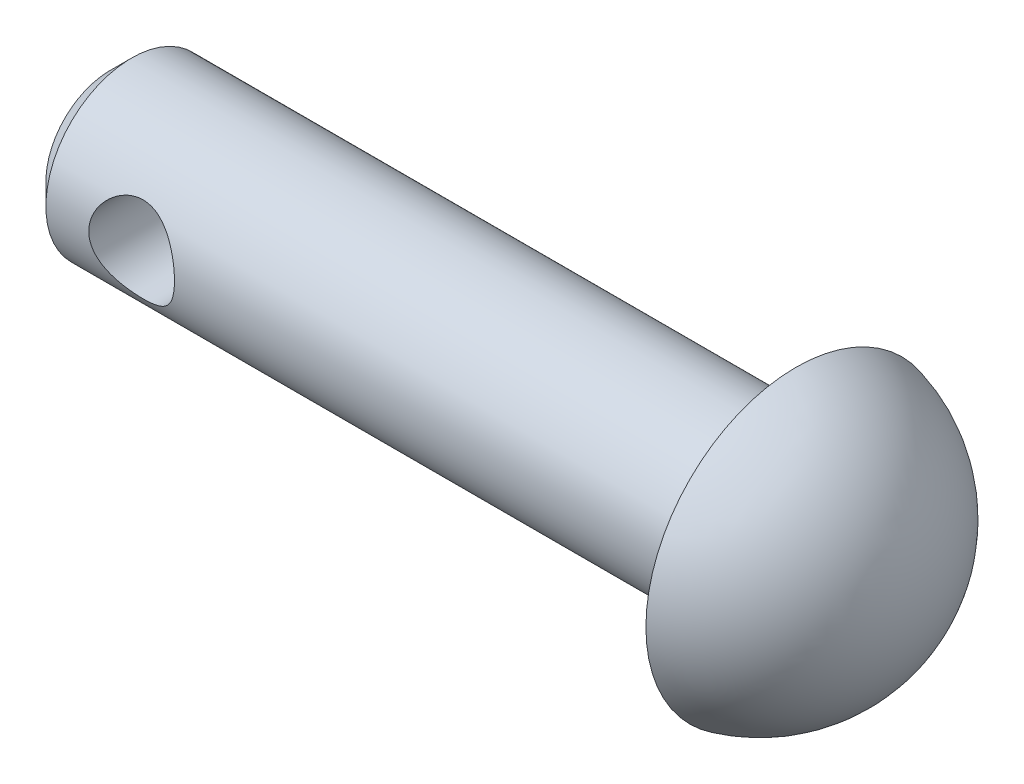
ISO-10303-21;
HEADER;
FILE_DESCRIPTION(('STEP AP214'),'2;1');
FILE_NAME('part.step','',(''),(''),'','','');
FILE_SCHEMA(('AUTOMOTIVE_DESIGN { 1 0 10303 214 1 1 1 1 }'));
ENDSEC;
DATA;
#1=APPLICATION_CONTEXT('core data for automotive mechanical design processes');
#2=APPLICATION_PROTOCOL_DEFINITION('international standard','automotive_design',2000,#1);
#3=PRODUCT_CONTEXT('',#1,'mechanical');
#4=PRODUCT('Part','Part','',(#3));
#5=PRODUCT_RELATED_PRODUCT_CATEGORY('part','',(#4));
#6=PRODUCT_DEFINITION_FORMATION('','',#4);
#7=PRODUCT_DEFINITION_CONTEXT('part definition',#1,'design');
#8=PRODUCT_DEFINITION('design','',#6,#7);
#9=PRODUCT_DEFINITION_SHAPE('','',#8);
#10=(LENGTH_UNIT() NAMED_UNIT(*) SI_UNIT(.MILLI.,.METRE.));
#11=(NAMED_UNIT(*) PLANE_ANGLE_UNIT() SI_UNIT($,.RADIAN.));
#12=(NAMED_UNIT(*) SI_UNIT($,.STERADIAN.) SOLID_ANGLE_UNIT());
#13=UNCERTAINTY_MEASURE_WITH_UNIT(LENGTH_MEASURE(1.E-05),#10,'distance_accuracy_value','');
#14=(GEOMETRIC_REPRESENTATION_CONTEXT(3) GLOBAL_UNCERTAINTY_ASSIGNED_CONTEXT((#13)) GLOBAL_UNIT_ASSIGNED_CONTEXT((#10,
#11,#12)) REPRESENTATION_CONTEXT('',''));
#15=CARTESIAN_POINT('',(0.,0.,0.));
#16=DIRECTION('',(0.,0.,1.));
#17=DIRECTION('',(1.,0.,0.));
#18=AXIS2_PLACEMENT_3D('',#15,#16,#17);
#19=CARTESIAN_POINT('',(-16.,0.,0.));
#20=DIRECTION('',(1.,0.,0.));
#21=DIRECTION('',(0.,0.,-1.));
#22=AXIS2_PLACEMENT_3D('',#19,#20,#21);
#23=CYLINDRICAL_SURFACE('',#22,2.);
#24=CARTESIAN_POINT('',(-15.5,0.,0.));
#25=DIRECTION('',(1.,0.,0.));
#26=DIRECTION('',(0.,0.,-1.));
#27=AXIS2_PLACEMENT_3D('',#24,#25,#26);
#28=CIRCLE('',#27,2.);
#29=CARTESIAN_POINT('',(-15.5,0.,-2.));
#30=VERTEX_POINT('',#29);
#31=EDGE_CURVE('E39',#30,#30,#28,.T.);
#32=ORIENTED_EDGE('',*,*,#31,.T.);
#33=EDGE_LOOP('',(#32));
#34=FACE_BOUND('',#33,.T.);
#35=CARTESIAN_POINT('',(-12.5,0.,-2.));
#36=CARTESIAN_POINT('',(-12.5000033023195,-0.0525719629529866,-1.99999713404151));
#37=CARTESIAN_POINT('',(-12.5041700731217,-0.105206599698033,-1.99790491019518));
#38=CARTESIAN_POINT('',(-12.5206528803409,-0.208920235268425,-1.98974156037396));
#39=CARTESIAN_POINT('',(-12.5329843929976,-0.259996086713504,-1.98366287828984));
#40=CARTESIAN_POINT('',(-12.5651938086168,-0.358933544880575,-1.96816279403312));
#41=CARTESIAN_POINT('',(-12.585042384248,-0.40680680293918,-1.9587543917752));
#42=CARTESIAN_POINT('',(-12.6315706213649,-0.498472616806565,-1.93745776515779));
#43=CARTESIAN_POINT('',(-12.6582497442489,-0.54226549399005,-1.9255697363353));
#44=CARTESIAN_POINT('',(-12.7195172494853,-0.627507817761919,-1.89956258258057));
#45=CARTESIAN_POINT('',(-12.7544864792396,-0.668655211122112,-1.88535199127536));
#46=CARTESIAN_POINT('',(-12.830521479247,-0.744779444866978,-1.85659970246744));
#47=CARTESIAN_POINT('',(-12.8715918517724,-0.779751583106767,-1.84205776209035));
#48=CARTESIAN_POINT('',(-12.9624833495234,-0.845252000450279,-1.81298951197347));
#49=CARTESIAN_POINT('',(-13.0127360983459,-0.875225335551638,-1.79855186970132));
#50=CARTESIAN_POINT('',(-13.1183673359862,-0.926168226890696,-1.77285978772321));
#51=CARTESIAN_POINT('',(-13.1737421287227,-0.947144214966335,-1.7616030760699));
#52=CARTESIAN_POINT('',(-13.2846651054219,-0.97813244218859,-1.74457867037808));
#53=CARTESIAN_POINT('',(-13.3400044520674,-0.988725857080443,-1.73852271583713));
#54=CARTESIAN_POINT('',(-13.4519788377795,-1.00042699330885,-1.73181889948528));
#55=CARTESIAN_POINT('',(-13.5086125408712,-1.00154408837308,-1.73116569343288));
#56=CARTESIAN_POINT('',(-13.6142860243154,-0.994687287172296,-1.73510930257248));
#57=CARTESIAN_POINT('',(-13.6634240312231,-0.987784559536823,-1.73908763662014));
#58=CARTESIAN_POINT('',(-13.759721909373,-0.966939849056934,-1.7507622873385));
#59=CARTESIAN_POINT('',(-13.8068811453053,-0.952995623897653,-1.75845978831776));
#60=CARTESIAN_POINT('',(-13.8992291325657,-0.918209780386005,-1.77687476412741));
#61=CARTESIAN_POINT('',(-13.9443463987858,-0.897215067115996,-1.78765840663998));
#62=CARTESIAN_POINT('',(-14.03063429259,-0.849041687668004,-1.81103404281404));
#63=CARTESIAN_POINT('',(-14.0718031356001,-0.821860243812469,-1.82362684780191));
#64=CARTESIAN_POINT('',(-14.1545212527432,-0.75806605491279,-1.85113157903286));
#65=CARTESIAN_POINT('',(-14.1954568735762,-0.720694458369283,-1.86613510236746));
#66=CARTESIAN_POINT('',(-14.2707354185909,-0.639555578741375,-1.89547623300407));
#67=CARTESIAN_POINT('',(-14.3050751920339,-0.595785256574287,-1.90981351958801));
#68=CARTESIAN_POINT('',(-14.3676856610297,-0.50051650583185,-1.93701987282964));
#69=CARTESIAN_POINT('',(-14.3956004724457,-0.44875359159941,-1.94978984162007));
#70=CARTESIAN_POINT('',(-14.442097029043,-0.340466215488798,-1.97157881121242));
#71=CARTESIAN_POINT('',(-14.4606861850152,-0.283945576265278,-1.98060078943553));
#72=CARTESIAN_POINT('',(-14.4864754037167,-0.172766491660703,-1.99324333741436));
#73=CARTESIAN_POINT('',(-14.4944912357468,-0.118341530548326,-1.99724938301312));
#74=CARTESIAN_POINT('',(-14.5014647311345,-0.00877959994935492,-2.00073013459102));
#75=CARTESIAN_POINT('',(-14.5004266856395,0.0463570198699002,-2.00020698721312));
#76=CARTESIAN_POINT('',(-14.4897933115812,0.151232971985993,-1.99491192253441));
#77=CARTESIAN_POINT('',(-14.48086746727,0.201059408049953,-1.9904724568819));
#78=CARTESIAN_POINT('',(-14.4557619281049,0.298406892301916,-1.97822171314819));
#79=CARTESIAN_POINT('',(-14.4395814335466,0.345927685690996,-1.97041006334333));
#80=CARTESIAN_POINT('',(-14.4000015335668,0.438888608449665,-1.9518425141367));
#81=CARTESIAN_POINT('',(-14.3764089498832,0.484230397006154,-1.94100881769939));
#82=CARTESIAN_POINT('',(-14.322892464354,0.570461361698921,-1.91743974317109));
#83=CARTESIAN_POINT('',(-14.2929658654066,0.611348629775282,-1.90470355565785));
#84=CARTESIAN_POINT('',(-14.2242395746671,0.691767689290653,-1.87708221337464));
#85=CARTESIAN_POINT('',(-14.1848571315464,0.730772077824639,-1.86210884848441));
#86=CARTESIAN_POINT('',(-14.1000748487307,0.80185632111324,-1.83262391603874));
#87=CARTESIAN_POINT('',(-14.0546708811836,0.833931385690841,-1.81811267381526));
#88=CARTESIAN_POINT('',(-13.9563563457997,0.891707914497696,-1.79051192226068));
#89=CARTESIAN_POINT('',(-13.9031887337914,0.917025495878639,-1.77752529663472));
#90=CARTESIAN_POINT('',(-13.7924899323075,0.958082826013804,-1.75574072368126));
#91=CARTESIAN_POINT('',(-13.7349644734988,0.973834915887571,-1.74693738240618));
#92=CARTESIAN_POINT('',(-13.6230897771386,0.99386168744968,-1.73561501008667));
#93=CARTESIAN_POINT('',(-13.568965746571,0.999092996400866,-1.73257383460491));
#94=CARTESIAN_POINT('',(-13.4605529328293,1.00068915438079,-1.73165354646175));
#95=CARTESIAN_POINT('',(-13.4062642312606,0.9970578466244,-1.73377219627553));
#96=CARTESIAN_POINT('',(-13.304516498468,0.981926125592265,-1.74237862050025));
#97=CARTESIAN_POINT('',(-13.2568995298556,0.971208314342801,-1.74843094482394));
#98=CARTESIAN_POINT('',(-13.1641918805753,0.943175358224647,-1.76371016187917));
#99=CARTESIAN_POINT('',(-13.119102017908,0.925858091159812,-1.77293807569675));
#100=CARTESIAN_POINT('',(-13.0293751490134,0.883815745300685,-1.79428530364528));
#101=CARTESIAN_POINT('',(-12.9849720981703,0.85867113781646,-1.80655722396191));
#102=CARTESIAN_POINT('',(-12.9007254638194,0.802150971636637,-1.8323533163459));
#103=CARTESIAN_POINT('',(-12.8608842694815,0.77077217123865,-1.84587813794522));
#104=CARTESIAN_POINT('',(-12.7818580176424,0.698203326664643,-1.87462323159313));
#105=CARTESIAN_POINT('',(-12.7433408976381,0.656284423010173,-1.88984983311469));
#106=CARTESIAN_POINT('',(-12.6737370165764,0.56615480622028,-1.91877752255088));
#107=CARTESIAN_POINT('',(-12.6426542605737,0.517940723256786,-1.9324777860804));
#108=CARTESIAN_POINT('',(-12.5887636372378,0.415931596819948,-1.95698009585103));
#109=CARTESIAN_POINT('',(-12.5660158305886,0.362099503934616,-1.96776096562909));
#110=CARTESIAN_POINT('',(-12.530191832081,0.250742101294193,-1.98501341363465));
#111=CARTESIAN_POINT('',(-12.5170881531704,0.193227799623168,-1.99149723372932));
#112=CARTESIAN_POINT('',(-12.5061025889241,0.112601946483385,-1.99695461909663));
#113=CARTESIAN_POINT('',(-12.5038173591364,0.0901618794395,-1.99809365339202));
#114=CARTESIAN_POINT('',(-12.5007653344832,0.0451517318071585,-1.99961696977865));
#115=CARTESIAN_POINT('',(-12.4999985815288,0.0225816476473818,-2.00000123103763));
#116=CARTESIAN_POINT('',(-12.5,0.,-2.));
#117=B_SPLINE_CURVE_WITH_KNOTS('',3,(#35,#36,#37,#38,#39,#40,#41,#42,#43,#44,#45,#46,#47,#48,
#49,#50,#51,#52,#53,#54,#55,#56,#57,#58,#59,#60,#61,#62,#63,#64,#65,#66,#67,#68,#69,#70,#71,#72,
#73,#74,#75,#76,#77,#78,#79,#80,#81,#82,#83,#84,#85,#86,#87,#88,#89,#90,#91,#92,#93,#94,#95,#96,
#97,#98,#99,#100,#101,#102,#103,#104,#105,#106,#107,#108,#109,#110,#111,#112,#113,#114,#115,
#116),.UNSPECIFIED.,.T.,.F.,(4,2,2,2,2,2,2,2,2,2,2,2,2,2,2,2,2,2,2,2,2,2,2,2,2,2,2,2,2,2,2,2,2,
2,2,2,2,2,2,2,4),(0.,0.157624257420293,0.315548149709198,0.472862155492298,0.630163760581568,
0.796981758718089,0.963926237654036,1.14381726430753,1.32357947898281,1.4925801214023,
1.66141357329021,1.81005712409321,1.95874803925679,2.11090240168487,2.26312521260222,
2.43464941333879,2.60625534598687,2.78583022214441,2.9652621691228,3.12983290471346,
3.29432564511476,3.44606906506122,3.59782921630932,3.75392856027899,3.9100945074834,
4.08159610644419,4.25321588615432,4.43314682159675,4.61284511940778,4.77529307498374,
4.93767059860006,5.08457930244183,5.23153528783678,5.38836456775615,5.54527561138958,
5.72125242752499,5.89732383376573,6.07464013662926,6.25144908624931,6.31915280137698,
6.38685838514848),.UNSPECIFIED.);
#118=CARTESIAN_POINT('',(-12.5,0.,-2.));
#119=VERTEX_POINT('',#118);
#120=EDGE_CURVE('E43',#119,#119,#117,.T.);
#121=ORIENTED_EDGE('',*,*,#120,.F.);
#122=EDGE_LOOP('',(#121));
#123=FACE_BOUND('',#122,.T.);
#124=CARTESIAN_POINT('',(-12.5,0.,2.));
#125=CARTESIAN_POINT('',(-12.5000033023195,0.0525719629529866,1.99999713404151));
#126=CARTESIAN_POINT('',(-12.5041700731217,0.105206599698033,1.99790491019518));
#127=CARTESIAN_POINT('',(-12.5206528803409,0.208920235268425,1.98974156037396));
#128=CARTESIAN_POINT('',(-12.5329843929976,0.259996086713504,1.98366287828984));
#129=CARTESIAN_POINT('',(-12.5651938086168,0.358933544880575,1.96816279403312));
#130=CARTESIAN_POINT('',(-12.585042384248,0.40680680293918,1.9587543917752));
#131=CARTESIAN_POINT('',(-12.6315706213649,0.498472616806565,1.93745776515779));
#132=CARTESIAN_POINT('',(-12.6582497442489,0.54226549399005,1.9255697363353));
#133=CARTESIAN_POINT('',(-12.7195172494853,0.627507817761919,1.89956258258057));
#134=CARTESIAN_POINT('',(-12.7544864792396,0.668655211122112,1.88535199127536));
#135=CARTESIAN_POINT('',(-12.830521479247,0.744779444866978,1.85659970246744));
#136=CARTESIAN_POINT('',(-12.8715918517724,0.779751583106767,1.84205776209035));
#137=CARTESIAN_POINT('',(-12.9624833495234,0.845252000450279,1.81298951197347));
#138=CARTESIAN_POINT('',(-13.0127360983459,0.875225335551638,1.79855186970132));
#139=CARTESIAN_POINT('',(-13.1183673359862,0.926168226890696,1.77285978772321));
#140=CARTESIAN_POINT('',(-13.1737421287227,0.947144214966335,1.7616030760699));
#141=CARTESIAN_POINT('',(-13.2846651054219,0.97813244218859,1.74457867037808));
#142=CARTESIAN_POINT('',(-13.3400044520674,0.988725857080443,1.73852271583713));
#143=CARTESIAN_POINT('',(-13.4519788377795,1.00042699330885,1.73181889948528));
#144=CARTESIAN_POINT('',(-13.5086125408712,1.00154408837308,1.73116569343288));
#145=CARTESIAN_POINT('',(-13.6142860243154,0.994687287172296,1.73510930257248));
#146=CARTESIAN_POINT('',(-13.6634240312231,0.987784559536823,1.73908763662014));
#147=CARTESIAN_POINT('',(-13.759721909373,0.966939849056934,1.7507622873385));
#148=CARTESIAN_POINT('',(-13.8068811453053,0.952995623897653,1.75845978831776));
#149=CARTESIAN_POINT('',(-13.8992291325657,0.918209780386005,1.77687476412741));
#150=CARTESIAN_POINT('',(-13.9443463987858,0.897215067115996,1.78765840663998));
#151=CARTESIAN_POINT('',(-14.03063429259,0.849041687668004,1.81103404281404));
#152=CARTESIAN_POINT('',(-14.0718031356001,0.821860243812469,1.82362684780191));
#153=CARTESIAN_POINT('',(-14.1545212527432,0.75806605491279,1.85113157903286));
#154=CARTESIAN_POINT('',(-14.1954568735762,0.720694458369283,1.86613510236746));
#155=CARTESIAN_POINT('',(-14.2707354185909,0.639555578741375,1.89547623300407));
#156=CARTESIAN_POINT('',(-14.3050751920339,0.595785256574287,1.90981351958801));
#157=CARTESIAN_POINT('',(-14.3676856610297,0.50051650583185,1.93701987282964));
#158=CARTESIAN_POINT('',(-14.3956004724457,0.44875359159941,1.94978984162007));
#159=CARTESIAN_POINT('',(-14.442097029043,0.340466215488798,1.97157881121242));
#160=CARTESIAN_POINT('',(-14.4606861850152,0.283945576265278,1.98060078943553));
#161=CARTESIAN_POINT('',(-14.4864754037167,0.172766491660703,1.99324333741436));
#162=CARTESIAN_POINT('',(-14.4944912357468,0.118341530548326,1.99724938301312));
#163=CARTESIAN_POINT('',(-14.5014647311345,0.00877959994935492,2.00073013459102));
#164=CARTESIAN_POINT('',(-14.5004266856395,-0.0463570198699002,2.00020698721312));
#165=CARTESIAN_POINT('',(-14.4897933115812,-0.151232971985993,1.99491192253441));
#166=CARTESIAN_POINT('',(-14.48086746727,-0.201059408049953,1.9904724568819));
#167=CARTESIAN_POINT('',(-14.4557619281049,-0.298406892301916,1.97822171314819));
#168=CARTESIAN_POINT('',(-14.4395814335466,-0.345927685690996,1.97041006334333));
#169=CARTESIAN_POINT('',(-14.4000015335668,-0.438888608449665,1.9518425141367));
#170=CARTESIAN_POINT('',(-14.3764089498832,-0.484230397006154,1.94100881769939));
#171=CARTESIAN_POINT('',(-14.322892464354,-0.570461361698921,1.91743974317109));
#172=CARTESIAN_POINT('',(-14.2929658654066,-0.611348629775282,1.90470355565785));
#173=CARTESIAN_POINT('',(-14.2242395746671,-0.691767689290653,1.87708221337464));
#174=CARTESIAN_POINT('',(-14.1848571315464,-0.730772077824639,1.86210884848441));
#175=CARTESIAN_POINT('',(-14.1000748487307,-0.80185632111324,1.83262391603874));
#176=CARTESIAN_POINT('',(-14.0546708811836,-0.833931385690841,1.81811267381526));
#177=CARTESIAN_POINT('',(-13.9563563457997,-0.891707914497696,1.79051192226068));
#178=CARTESIAN_POINT('',(-13.9031887337914,-0.917025495878639,1.77752529663472));
#179=CARTESIAN_POINT('',(-13.7924899323075,-0.958082826013804,1.75574072368126));
#180=CARTESIAN_POINT('',(-13.7349644734988,-0.973834915887571,1.74693738240618));
#181=CARTESIAN_POINT('',(-13.6230897771386,-0.99386168744968,1.73561501008667));
#182=CARTESIAN_POINT('',(-13.568965746571,-0.999092996400866,1.73257383460491));
#183=CARTESIAN_POINT('',(-13.4605529328293,-1.00068915438079,1.73165354646175));
#184=CARTESIAN_POINT('',(-13.4062642312606,-0.9970578466244,1.73377219627553));
#185=CARTESIAN_POINT('',(-13.304516498468,-0.981926125592265,1.74237862050025));
#186=CARTESIAN_POINT('',(-13.2568995298556,-0.971208314342801,1.74843094482394));
#187=CARTESIAN_POINT('',(-13.1641918805753,-0.943175358224647,1.76371016187917));
#188=CARTESIAN_POINT('',(-13.119102017908,-0.925858091159812,1.77293807569675));
#189=CARTESIAN_POINT('',(-13.0293751490134,-0.883815745300685,1.79428530364528));
#190=CARTESIAN_POINT('',(-12.9849720981703,-0.85867113781646,1.80655722396191));
#191=CARTESIAN_POINT('',(-12.9007254638194,-0.802150971636637,1.8323533163459));
#192=CARTESIAN_POINT('',(-12.8608842694815,-0.77077217123865,1.84587813794522));
#193=CARTESIAN_POINT('',(-12.7818580176424,-0.698203326664643,1.87462323159313));
#194=CARTESIAN_POINT('',(-12.7433408976381,-0.656284423010173,1.88984983311469));
#195=CARTESIAN_POINT('',(-12.6737370165764,-0.56615480622028,1.91877752255088));
#196=CARTESIAN_POINT('',(-12.6426542605737,-0.517940723256786,1.9324777860804));
#197=CARTESIAN_POINT('',(-12.5887636372378,-0.415931596819948,1.95698009585103));
#198=CARTESIAN_POINT('',(-12.5660158305886,-0.362099503934616,1.96776096562909));
#199=CARTESIAN_POINT('',(-12.530191832081,-0.250742101294193,1.98501341363465));
#200=CARTESIAN_POINT('',(-12.5170881531704,-0.193227799623168,1.99149723372932));
#201=CARTESIAN_POINT('',(-12.5061025889241,-0.112601946483385,1.99695461909663));
#202=CARTESIAN_POINT('',(-12.5038173591364,-0.0901618794395,1.99809365339202));
#203=CARTESIAN_POINT('',(-12.5007653344832,-0.0451517318071585,1.99961696977865));
#204=CARTESIAN_POINT('',(-12.4999985815288,-0.0225816476473818,2.00000123103763));
#205=CARTESIAN_POINT('',(-12.5,0.,2.));
#206=B_SPLINE_CURVE_WITH_KNOTS('',3,(#124,#125,#126,#127,#128,#129,#130,#131,#132,#133,#134,
#135,#136,#137,#138,#139,#140,#141,#142,#143,#144,#145,#146,#147,#148,#149,#150,#151,#152,#153,
#154,#155,#156,#157,#158,#159,#160,#161,#162,#163,#164,#165,#166,#167,#168,#169,#170,#171,#172,
#173,#174,#175,#176,#177,#178,#179,#180,#181,#182,#183,#184,#185,#186,#187,#188,#189,#190,#191,
#192,#193,#194,#195,#196,#197,#198,#199,#200,#201,#202,#203,#204,#205),.UNSPECIFIED.,.T.,.F.,(4,
2,2,2,2,2,2,2,2,2,2,2,2,2,2,2,2,2,2,2,2,2,2,2,2,2,2,2,2,2,2,2,2,2,2,2,2,2,2,2,4),(0.,
0.157624257420293,0.315548149709198,0.472862155492298,0.630163760581568,0.796981758718089,
0.963926237654036,1.14381726430753,1.32357947898281,1.4925801214023,1.66141357329021,
1.81005712409321,1.95874803925679,2.11090240168487,2.26312521260222,2.43464941333879,
2.60625534598687,2.78583022214441,2.9652621691228,3.12983290471346,3.29432564511476,
3.44606906506122,3.59782921630932,3.75392856027899,3.9100945074834,4.08159610644419,
4.25321588615432,4.43314682159675,4.61284511940778,4.77529307498374,4.93767059860006,
5.08457930244183,5.23153528783678,5.38836456775615,5.54527561138958,5.72125242752499,
5.89732383376573,6.07464013662926,6.25144908624931,6.31915280137698,6.38685838514848),.UNSPECIFIED.);
#207=CARTESIAN_POINT('',(-12.5,0.,2.));
#208=VERTEX_POINT('',#207);
#209=EDGE_CURVE('E47',#208,#208,#206,.T.);
#210=ORIENTED_EDGE('',*,*,#209,.F.);
#211=EDGE_LOOP('',(#210));
#212=FACE_BOUND('',#211,.T.);
#213=CARTESIAN_POINT('',(0.,0.,0.));
#214=DIRECTION('',(1.,0.,0.));
#215=DIRECTION('',(0.,0.,-1.));
#216=AXIS2_PLACEMENT_3D('',#213,#214,#215);
#217=CIRCLE('',#216,2.);
#218=CARTESIAN_POINT('',(0.,0.,-2.));
#219=VERTEX_POINT('',#218);
#220=EDGE_CURVE('E83',#219,#219,#217,.T.);
#221=ORIENTED_EDGE('',*,*,#220,.F.);
#222=EDGE_LOOP('',(#221));
#223=FACE_BOUND('',#222,.T.);
#224=ADVANCED_FACE('F32',(#34,#123,#212,#223),#23,.T.);
#225=CARTESIAN_POINT('',(-16.,0.,0.));
#226=DIRECTION('',(1.,0.,0.));
#227=DIRECTION('',(0.,0.,-1.));
#228=AXIS2_PLACEMENT_3D('',#225,#226,#227);
#229=PLANE('',#228);
#230=CARTESIAN_POINT('',(-16.,0.,0.));
#231=DIRECTION('',(1.,0.,0.));
#232=DIRECTION('',(0.,0.,-1.));
#233=AXIS2_PLACEMENT_3D('',#230,#231,#232);
#234=CIRCLE('',#233,1.5);
#235=CARTESIAN_POINT('',(-16.,0.,-1.5));
#236=VERTEX_POINT('',#235);
#237=EDGE_CURVE('E10',#236,#236,#234,.F.);
#238=ORIENTED_EDGE('',*,*,#237,.T.);
#239=EDGE_LOOP('',(#238));
#240=FACE_BOUND('',#239,.T.);
#241=ADVANCED_FACE('F65',(#240),#229,.F.);
#242=CARTESIAN_POINT('',(-13.5,0.,-2.));
#243=DIRECTION('',(0.,0.,1.));
#244=DIRECTION('',(1.,0.,0.));
#245=AXIS2_PLACEMENT_3D('',#242,#243,#244);
#246=CYLINDRICAL_SURFACE('',#245,1.);
#247=ORIENTED_EDGE('',*,*,#120,.T.);
#248=EDGE_LOOP('',(#247));
#249=FACE_BOUND('',#248,.T.);
#250=ORIENTED_EDGE('',*,*,#209,.T.);
#251=EDGE_LOOP('',(#250));
#252=FACE_BOUND('',#251,.T.);
#253=ADVANCED_FACE('F60',(#249,#252),#246,.F.);
#254=CARTESIAN_POINT('',(-0.842614977317635,0.,0.));
#255=DIRECTION('',(-1.,0.,0.));
#256=DIRECTION('',(0.,0.,-1.));
#257=AXIS2_PLACEMENT_3D('',#254,#255,#256);
#258=SPHERICAL_SURFACE('',#257,3.6);
#259=CARTESIAN_POINT('',(0.,0.,0.));
#260=DIRECTION('',(-1.,0.,0.));
#261=DIRECTION('',(0.,0.,1.));
#262=AXIS2_PLACEMENT_3D('',#259,#260,#261);
#263=CIRCLE('',#262,3.5);
#264=CARTESIAN_POINT('',(0.,0.,3.5));
#265=VERTEX_POINT('',#264);
#266=EDGE_CURVE('E85',#265,#265,#263,.T.);
#267=ORIENTED_EDGE('',*,*,#266,.F.);
#268=EDGE_LOOP('',(#267));
#269=FACE_BOUND('',#268,.T.);
#270=ADVANCED_FACE('F64',(#269),#258,.T.);
#271=CARTESIAN_POINT('',(0.,0.,0.));
#272=DIRECTION('',(1.,0.,0.));
#273=DIRECTION('',(0.,0.,-1.));
#274=AXIS2_PLACEMENT_3D('',#271,#272,#273);
#275=PLANE('',#274);
#276=ORIENTED_EDGE('',*,*,#220,.T.);
#277=EDGE_LOOP('',(#276));
#278=FACE_BOUND('',#277,.T.);
#279=ORIENTED_EDGE('',*,*,#266,.T.);
#280=EDGE_LOOP('',(#279));
#281=FACE_BOUND('',#280,.T.);
#282=ADVANCED_FACE('F90',(#278,#281),#275,.F.);
#283=CARTESIAN_POINT('',(-15.5,0.,0.));
#284=DIRECTION('',(1.,0.,0.));
#285=DIRECTION('',(0.,0.,-1.));
#286=AXIS2_PLACEMENT_3D('',#283,#284,#285);
#287=CONICAL_SURFACE('',#286,2.,0.785398163397452);
#288=ORIENTED_EDGE('',*,*,#237,.F.);
#289=EDGE_LOOP('',(#288));
#290=FACE_BOUND('',#289,.T.);
#291=ORIENTED_EDGE('',*,*,#31,.F.);
#292=EDGE_LOOP('',(#291));
#293=FACE_BOUND('',#292,.T.);
#294=ADVANCED_FACE('F34',(#290,#293),#287,.T.);
#295=CLOSED_SHELL('',(#224,#241,#253,#270,#282,#294));
#296=MANIFOLD_SOLID_BREP('B2',#295);
#297=ADVANCED_BREP_SHAPE_REPRESENTATION('',(#18,#296),#14);
#298=SHAPE_DEFINITION_REPRESENTATION(#9,#297);
ENDSEC;
END-ISO-10303-21;
